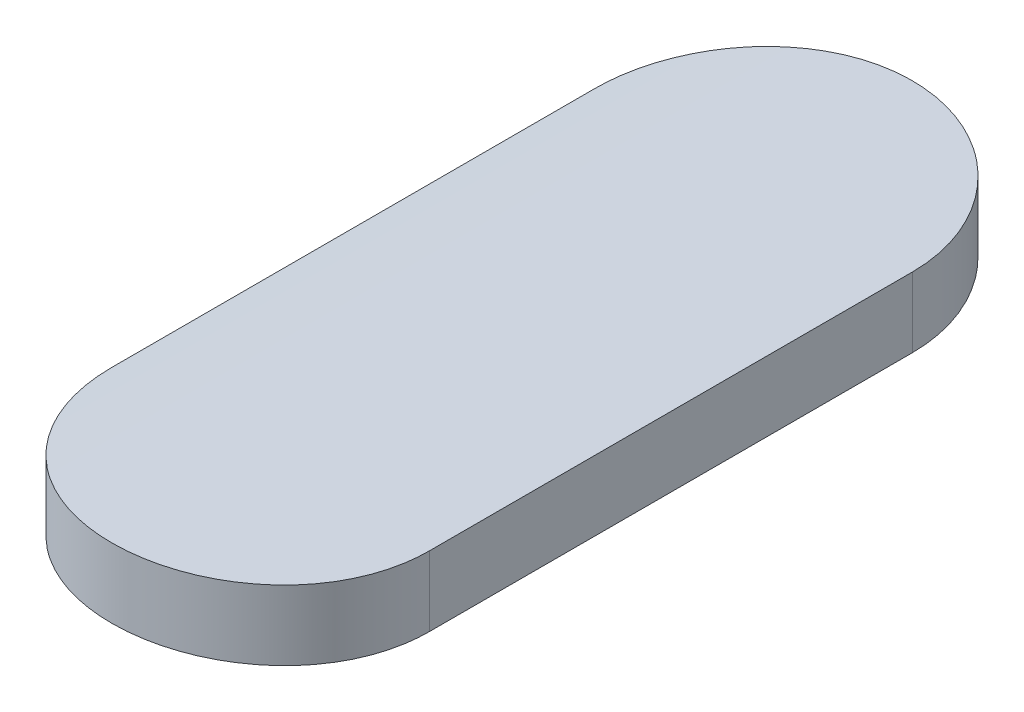
ISO-10303-21;
HEADER;
FILE_DESCRIPTION(('STEP AP214'),'2;1');
FILE_NAME('part.step','',(''),(''),'','','');
FILE_SCHEMA(('AUTOMOTIVE_DESIGN { 1 0 10303 214 1 1 1 1 }'));
ENDSEC;
DATA;
#1=APPLICATION_CONTEXT('core data for automotive mechanical design processes');
#2=APPLICATION_PROTOCOL_DEFINITION('international standard','automotive_design',2000,#1);
#3=PRODUCT_CONTEXT('',#1,'mechanical');
#4=PRODUCT('Part','Part','',(#3));
#5=PRODUCT_RELATED_PRODUCT_CATEGORY('part','',(#4));
#6=PRODUCT_DEFINITION_FORMATION('','',#4);
#7=PRODUCT_DEFINITION_CONTEXT('part definition',#1,'design');
#8=PRODUCT_DEFINITION('design','',#6,#7);
#9=PRODUCT_DEFINITION_SHAPE('','',#8);
#10=(LENGTH_UNIT() NAMED_UNIT(*) SI_UNIT(.MILLI.,.METRE.));
#11=(NAMED_UNIT(*) PLANE_ANGLE_UNIT() SI_UNIT($,.RADIAN.));
#12=(NAMED_UNIT(*) SI_UNIT($,.STERADIAN.) SOLID_ANGLE_UNIT());
#13=UNCERTAINTY_MEASURE_WITH_UNIT(LENGTH_MEASURE(1.E-05),#10,'distance_accuracy_value','');
#14=(GEOMETRIC_REPRESENTATION_CONTEXT(3) GLOBAL_UNCERTAINTY_ASSIGNED_CONTEXT((#13)) GLOBAL_UNIT_ASSIGNED_CONTEXT((#10,
#11,#12)) REPRESENTATION_CONTEXT('',''));
#15=CARTESIAN_POINT('',(0.,0.,0.));
#16=DIRECTION('',(0.,0.,1.));
#17=DIRECTION('',(1.,0.,0.));
#18=AXIS2_PLACEMENT_3D('',#15,#16,#17);
#19=CARTESIAN_POINT('',(-102.183303397109,-58.0021041199526,0.810125243112793));
#20=DIRECTION('',(0.,0.,1.));
#21=DIRECTION('',(1.,0.,0.));
#22=AXIS2_PLACEMENT_3D('',#19,#20,#21);
#23=CYLINDRICAL_SURFACE('',#22,3.03);
#24=DIRECTION('',(0.,0.,1.));
#25=VECTOR('',#24,1.);
#26=CARTESIAN_POINT('',(-101.909719824806,-54.9844805468465,2.91890539461168));
#27=LINE('',#26,#25);
#28=CARTESIAN_POINT('',(-101.909719824806,-54.9844805468465,2.087211334809));
#29=VERTEX_POINT('',#28);
#30=CARTESIAN_POINT('',(-101.909719824806,-54.9844805468465,2.91890539461168));
#31=VERTEX_POINT('',#30);
#32=EDGE_CURVE('E63',#29,#31,#27,.T.);
#33=ORIENTED_EDGE('',*,*,#32,.T.);
#34=CARTESIAN_POINT('',(-102.456886969413,-54.9844805468465,2.91890539461168));
#35=CARTESIAN_POINT('',(-102.45690018856,-54.9844850850065,2.93426326797204));
#36=CARTESIAN_POINT('',(-102.455594583745,-54.9843634291541,2.94961652885538));
#37=CARTESIAN_POINT('',(-102.450444037557,-54.9839013638385,2.97987409353102));
#38=CARTESIAN_POINT('',(-102.446601388075,-54.9835611518201,2.99477878984865));
#39=CARTESIAN_POINT('',(-102.43647274975,-54.982695325965,3.02373442762979));
#40=CARTESIAN_POINT('',(-102.430185801304,-54.9821696393207,3.03778503127848));
#41=CARTESIAN_POINT('',(-102.41535362176,-54.9809936958497,3.06463003077991));
#42=CARTESIAN_POINT('',(-102.406808694357,-54.9803434557786,3.07742459525067));
#43=CARTESIAN_POINT('',(-102.387675519313,-54.9789891929714,3.10143281801022));
#44=CARTESIAN_POINT('',(-102.37708208878,-54.9782850366116,3.11264233874841));
#45=CARTESIAN_POINT('',(-102.354162558468,-54.976903511139,3.13312815470867));
#46=CARTESIAN_POINT('',(-102.341836195345,-54.9762261461177,3.14240415557377));
#47=CARTESIAN_POINT('',(-102.315775963507,-54.9749732653347,3.15877232350382));
#48=CARTESIAN_POINT('',(-102.30203976608,-54.9743979225072,3.16586079734287));
#49=CARTESIAN_POINT('',(-102.273566893701,-54.9734154280022,3.17762868466413));
#50=CARTESIAN_POINT('',(-102.258830299632,-54.9730082627462,3.18230829264124));
#51=CARTESIAN_POINT('',(-102.228816839615,-54.9724089065577,3.18911389149604));
#52=CARTESIAN_POINT('',(-102.213541557574,-54.9722161320768,3.19124681534253));
#53=CARTESIAN_POINT('',(-102.182848304728,-54.9720652956585,3.19291995032191));
#54=CARTESIAN_POINT('',(-102.167430333496,-54.972107234425,3.19246015367994));
#55=CARTESIAN_POINT('',(-102.13693723616,-54.9724206277345,3.18896646039311));
#56=CARTESIAN_POINT('',(-102.121861239453,-54.9726914108666,3.18594009376717));
#57=CARTESIAN_POINT('',(-102.092432133361,-54.9734312715637,3.17741089924443));
#58=CARTESIAN_POINT('',(-102.078079028347,-54.9739003503275,3.17190805637773));
#59=CARTESIAN_POINT('',(-102.050478912772,-54.9749852107613,3.15857364552087));
#60=CARTESIAN_POINT('',(-102.037233555316,-54.9756012065815,3.15073867398615));
#61=CARTESIAN_POINT('',(-102.012243656792,-54.9769106737635,3.13296527765198));
#62=CARTESIAN_POINT('',(-102.00049908344,-54.9776041434581,3.12302689811199));
#63=CARTESIAN_POINT('',(-101.978800875656,-54.9789935419706,3.10128783989949));
#64=CARTESIAN_POINT('',(-101.968853536883,-54.9796894710466,3.08948087650394));
#65=CARTESIAN_POINT('',(-101.951078187108,-54.9810031213351,3.06435723079201));
#66=CARTESIAN_POINT('',(-101.943250825879,-54.9816208185386,3.0510400873762));
#67=CARTESIAN_POINT('',(-101.929937183968,-54.9827084570826,3.02326549613394));
#68=CARTESIAN_POINT('',(-101.924452666358,-54.9831782870781,3.00880719920953));
#69=CARTESIAN_POINT('',(-101.916001398058,-54.9839144740036,2.97918744791656));
#70=CARTESIAN_POINT('',(-101.913030832485,-54.9841811391716,2.96402709591596));
#71=CARTESIAN_POINT('',(-101.910262288898,-54.9844315961996,2.93882571566526));
#72=CARTESIAN_POINT('',(-101.90971524255,-54.9844819522347,2.92886308187312));
#73=CARTESIAN_POINT('',(-101.909719824805,-54.9844805468465,2.91890539461168));
#74=B_SPLINE_CURVE_WITH_KNOTS('',3,(#34,#35,#36,#37,#38,#39,#40,#41,#42,#43,#44,#45,#46,#47,#48,
#49,#50,#51,#52,#53,#54,#55,#56,#57,#58,#59,#60,#61,#62,#63,#64,#65,#66,#67,#68,#69,#70,#71,#72,
#73),.UNSPECIFIED.,.F.,.F.,(4,2,2,2,2,2,2,2,2,2,2,2,2,2,2,2,2,2,2,4),(0.,0.0460110092394263,
0.0919805102672434,0.137968076626714,0.183949460880791,0.230048741249591,0.27615503460575,
0.322338749160998,0.368518734199196,0.414572712346615,0.460626828597777,0.506546292990887,
0.552466034963506,0.598453124267902,0.644439224158948,0.690583414231252,0.736741731520291,
0.782934723603281,0.829057492186285,0.85892871626178),.UNSPECIFIED.);
#75=CARTESIAN_POINT('',(-102.456886969413,-54.9844805468465,2.91890539461168));
#76=VERTEX_POINT('',#75);
#77=EDGE_CURVE('E21',#76,#31,#74,.T.);
#78=ORIENTED_EDGE('',*,*,#77,.F.);
#79=DIRECTION('',(0.,0.,-1.));
#80=VECTOR('',#79,1.);
#81=CARTESIAN_POINT('',(-102.456886969413,-54.9844805468465,2.087211334809));
#82=LINE('',#81,#80);
#83=CARTESIAN_POINT('',(-102.456886969413,-54.9844805468465,2.087211334809));
#84=VERTEX_POINT('',#83);
#85=EDGE_CURVE('E60',#76,#84,#82,.T.);
#86=ORIENTED_EDGE('',*,*,#85,.T.);
#87=CARTESIAN_POINT('',(-101.909719824805,-54.9844805468465,2.087211334809));
#88=CARTESIAN_POINT('',(-101.909706603611,-54.9844850849377,2.07185351137855));
#89=CARTESIAN_POINT('',(-101.91101220096,-54.9843634299103,2.05650030029874));
#90=CARTESIAN_POINT('',(-101.916162732774,-54.9839013660614,2.02624273282166));
#91=CARTESIAN_POINT('',(-101.920005391793,-54.983561153268,2.01133798671698));
#92=CARTESIAN_POINT('',(-101.930134151815,-54.9826953165674,1.98238198878401));
#93=CARTESIAN_POINT('',(-101.936421257281,-54.9821696164489,1.96833109056332));
#94=CARTESIAN_POINT('',(-101.951253551068,-54.9809936677021,1.94148614241005));
#95=CARTESIAN_POINT('',(-101.959798338105,-54.980343441213,1.92869186967649));
#96=CARTESIAN_POINT('',(-101.978930162296,-54.9789892694197,1.90468527296885));
#97=CARTESIAN_POINT('',(-101.989522196764,-54.9782851952686,1.89347693864892));
#98=CARTESIAN_POINT('',(-102.012441554963,-54.9769036653171,1.87299066518109));
#99=CARTESIAN_POINT('',(-102.024769532786,-54.9762262196739,1.86371345695052));
#100=CARTESIAN_POINT('',(-102.050837529914,-54.9749729209117,1.84733998425859));
#101=CARTESIAN_POINT('',(-102.064580476045,-54.9743972853461,1.84024836665392));
#102=CARTESIAN_POINT('',(-102.093057577958,-54.9734149909817,1.82848274613002));
#103=CARTESIAN_POINT('',(-102.107790555852,-54.9730081353731,1.82380592581219));
#104=CARTESIAN_POINT('',(-102.132720740683,-54.972510035285,1.81815184259439));
#105=CARTESIAN_POINT('',(-102.142760012056,-54.972358537245,1.81645765990129));
#106=CARTESIAN_POINT('',(-102.162965855142,-54.9721555261584,1.81419539226587));
#107=CARTESIAN_POINT('',(-102.173132429046,-54.9721040148336,1.81362732671486));
#108=CARTESIAN_POINT('',(-102.198637794649,-54.9721042784367,1.8136284195311));
#109=CARTESIAN_POINT('',(-102.21398218033,-54.9722217636421,1.81492130813206));
#110=CARTESIAN_POINT('',(-102.244245434795,-54.9726791209169,1.82005951096344));
#111=CARTESIAN_POINT('',(-102.259163830807,-54.9730192307578,1.82390755426018));
#112=CARTESIAN_POINT('',(-102.2881332593,-54.9738834186235,1.8340435272841));
#113=CARTESIAN_POINT('',(-102.302184779422,-54.97440739209,1.84033007051509));
#114=CARTESIAN_POINT('',(-102.329030317659,-54.9755806299851,1.85516219686659));
#115=CARTESIAN_POINT('',(-102.341824563905,-54.9762298716205,1.86370736912109));
#116=CARTESIAN_POINT('',(-102.365832699982,-54.9775829614183,1.8828409464477));
#117=CARTESIAN_POINT('',(-102.377042394913,-54.9782869471526,1.89343460553395));
#118=CARTESIAN_POINT('',(-102.397527723683,-54.9796690712488,1.91635426134947));
#119=CARTESIAN_POINT('',(-102.406803197114,-54.980347207463,1.92868040161448));
#120=CARTESIAN_POINT('',(-102.423172646041,-54.9816024211497,1.95474225105209));
#121=CARTESIAN_POINT('',(-102.430262308272,-54.9821792978532,1.96848067679207));
#122=CARTESIAN_POINT('',(-102.442029416205,-54.9831645823514,1.99695721882436));
#123=CARTESIAN_POINT('',(-102.446708164687,-54.9835730811081,2.01169479032806));
#124=CARTESIAN_POINT('',(-102.452364578077,-54.984073110083,2.03663670312068));
#125=CARTESIAN_POINT('',(-102.454059328348,-54.9842251554516,2.04668307209212));
#126=CARTESIAN_POINT('',(-102.456320437115,-54.9844291774748,2.0668886347348));
#127=CARTESIAN_POINT('',(-102.456888379817,-54.9844812946176,2.07704764978422));
#128=CARTESIAN_POINT('',(-102.456886969413,-54.9844805468465,2.087211334809));
#129=B_SPLINE_CURVE_WITH_KNOTS('',3,(#87,#88,#89,#90,#91,#92,#93,#94,#95,#96,#97,#98,#99,#100,
#101,#102,#103,#104,#105,#106,#107,#108,#109,#110,#111,#112,#113,#114,#115,#116,#117,#118,#119,
#120,#121,#122,#123,#124,#125,#126,#127,#128),.UNSPECIFIED.,.F.,.F.,(4,2,2,2,2,2,2,2,2,2,2,2,2,
2,2,2,2,2,2,2,4),(0.,0.0460108603236384,0.0919805102691049,0.13796906986794,0.183949460872792,
0.230043540383748,0.276155034576633,0.322363902164524,0.368518734300647,0.399006507520629,
0.429494805724186,0.475460900795526,0.521476169693505,0.567465313228801,0.613446096654021,
0.659546415719316,0.705650556441149,0.751845100716581,0.798014656700601,0.828523596054453,
0.858989611669718),.UNSPECIFIED.);
#130=EDGE_CURVE('E77',#29,#84,#129,.T.);
#131=ORIENTED_EDGE('',*,*,#130,.F.);
#132=EDGE_LOOP('',(#33,#78,#86,#131));
#133=FACE_BOUND('',#132,.T.);
#134=ADVANCED_FACE('F17',(#133),#23,.F.);
#135=CARTESIAN_POINT('',(-102.183303397109,-56.4871041199525,2.91890539461168));
#136=DIRECTION('',(0.,-1.,0.));
#137=DIRECTION('',(0.,0.,-1.));
#138=AXIS2_PLACEMENT_3D('',#135,#136,#137);
#139=CYLINDRICAL_SURFACE('',#138,0.273583572303515);
#140=DIRECTION('',(0.,1.,0.));
#141=VECTOR('',#140,1.);
#142=CARTESIAN_POINT('',(-102.456886969413,-56.4871041199525,2.91890539461168));
#143=LINE('',#142,#141);
#144=CARTESIAN_POINT('',(-102.456886969413,-54.8640072398411,2.91890539461168));
#145=VERTEX_POINT('',#144);
#146=EDGE_CURVE('E67',#145,#76,#143,.F.);
#147=ORIENTED_EDGE('',*,*,#146,.T.);
#148=ORIENTED_EDGE('',*,*,#77,.T.);
#149=DIRECTION('',(0.,1.,0.));
#150=VECTOR('',#149,1.);
#151=CARTESIAN_POINT('',(-101.909719824806,-56.4871041199525,2.91890539461168));
#152=LINE('',#151,#150);
#153=CARTESIAN_POINT('',(-101.909719824806,-54.8640072398411,2.91890539461168));
#154=VERTEX_POINT('',#153);
#155=EDGE_CURVE('E83',#31,#154,#152,.T.);
#156=ORIENTED_EDGE('',*,*,#155,.T.);
#157=CARTESIAN_POINT('',(-102.456886969413,-54.8640072398411,2.91890539461168));
#158=CARTESIAN_POINT('',(-102.45690017744,-54.8640116038495,2.93426574188204));
#159=CARTESIAN_POINT('',(-102.455594165121,-54.8638945821352,2.94962152986612));
#160=CARTESIAN_POINT('',(-102.450441862128,-54.8634501023721,2.97988435395533));
#161=CARTESIAN_POINT('',(-102.446597831778,-54.8631228315755,2.99479177702831));
#162=CARTESIAN_POINT('',(-102.43646531811,-54.8622899162493,3.02375284212875));
#163=CARTESIAN_POINT('',(-102.430175861723,-54.8617842007215,3.03780614171135));
#164=CARTESIAN_POINT('',(-102.415337557483,-54.8606529156442,3.06465598176264));
#165=CARTESIAN_POINT('',(-102.40678902391,-54.8600273627696,3.07745269670626));
#166=CARTESIAN_POINT('',(-102.387649540032,-54.858724650616,3.10146198054393));
#167=CARTESIAN_POINT('',(-102.37705378966,-54.85804737236,3.11267071692668));
#168=CARTESIAN_POINT('',(-102.354129746989,-54.8567186189181,3.13315438947129));
#169=CARTESIAN_POINT('',(-102.341801191367,-54.8560671476734,3.14242903118867));
#170=CARTESIAN_POINT('',(-102.315738757083,-54.8548623045616,3.15879278989864));
#171=CARTESIAN_POINT('',(-102.302002730673,-54.854309086249,3.1658784984769));
#172=CARTESIAN_POINT('',(-102.273531133867,-54.8533644337177,3.17764106408049));
#173=CARTESIAN_POINT('',(-102.258795643014,-54.8529729866417,3.18231811255018));
#174=CARTESIAN_POINT('',(-102.228782091928,-54.8523967862496,3.18911980974592));
#175=CARTESIAN_POINT('',(-102.213505495177,-54.8522115136778,3.19125087160693));
#176=CARTESIAN_POINT('',(-102.182810025518,-54.8520667749048,3.19291994150952));
#177=CARTESIAN_POINT('',(-102.167391151973,-54.8521073097163,3.19245793792023));
#178=CARTESIAN_POINT('',(-102.136893153251,-54.8524091989506,3.18895913638965));
#179=CARTESIAN_POINT('',(-102.121813221565,-54.8526699554928,3.18592930976002));
#180=CARTESIAN_POINT('',(-102.092376822884,-54.8533822737681,3.17739172534582));
#181=CARTESIAN_POINT('',(-102.078020359791,-54.8538338365303,3.17188395419732));
#182=CARTESIAN_POINT('',(-102.050415930298,-54.8548780121511,3.15853894972632));
#183=CARTESIAN_POINT('',(-102.037169500118,-54.8554708162598,3.15069855426435));
#184=CARTESIAN_POINT('',(-102.01217861772,-54.8567308333417,3.13291355438156));
#185=CARTESIAN_POINT('',(-102.000434130094,-54.8573980445601,3.12296899957858));
#186=CARTESIAN_POINT('',(-101.978740535791,-54.8587344683245,3.10122014370146));
#187=CARTESIAN_POINT('',(-101.968797240192,-54.8594036805078,3.0894100455299));
#188=CARTESIAN_POINT('',(-101.951030530104,-54.8606667104951,3.06428108165889));
#189=CARTESIAN_POINT('',(-101.943207767305,-54.8612605050917,3.05096175391694));
#190=CARTESIAN_POINT('',(-101.929903785219,-54.8623058530949,3.02318424409219));
#191=CARTESIAN_POINT('',(-101.924424292344,-54.8627573015633,3.00872523159907));
#192=CARTESIAN_POINT('',(-101.915982962283,-54.863464474176,2.97910532559388));
#193=CARTESIAN_POINT('',(-101.913017308266,-54.8637204949845,2.96394553313878));
#194=CARTESIAN_POINT('',(-101.910259349305,-54.8639604241394,2.93877172062167));
#195=CARTESIAN_POINT('',(-101.909715280934,-54.8640085803269,2.92883607901394));
#196=CARTESIAN_POINT('',(-101.909719824805,-54.8640072398411,2.91890539461168));
#197=B_SPLINE_CURVE_WITH_KNOTS('',3,(#157,#158,#159,#160,#161,#162,#163,#164,#165,#166,#167,
#168,#169,#170,#171,#172,#173,#174,#175,#176,#177,#178,#179,#180,#181,#182,#183,#184,#185,#186,
#187,#188,#189,#190,#191,#192,#193,#194,#195,#196),.UNSPECIFIED.,.F.,.F.,(4,2,2,2,2,2,2,2,2,2,2,
2,2,2,2,2,2,2,2,4),(0.,0.0460185269940187,0.0919961256717319,0.137992038231911,
0.183981555270097,0.230080241017493,0.276185939663906,0.322363072340185,0.368536534213801,
0.414593441972159,0.460650556313075,0.506583030539238,0.552515752488987,0.598511027446186,
0.644505217917067,0.690645251790524,0.736799449546953,0.782987593228105,0.82910548190241,
0.858895844339709),.UNSPECIFIED.);
#198=EDGE_CURVE('E70',#145,#154,#197,.T.);
#199=ORIENTED_EDGE('',*,*,#198,.F.);
#200=EDGE_LOOP('',(#147,#148,#156,#199));
#201=FACE_BOUND('',#200,.T.);
#202=ADVANCED_FACE('F68',(#201),#139,.T.);
#203=CARTESIAN_POINT('',(-101.909719824806,-56.4871041199525,2.91890539461168));
#204=DIRECTION('',(-1.,0.,0.));
#205=DIRECTION('',(0.,0.,1.));
#206=AXIS2_PLACEMENT_3D('',#203,#204,#205);
#207=PLANE('',#206);
#208=DIRECTION('',(0.,0.,1.));
#209=VECTOR('',#208,1.);
#210=CARTESIAN_POINT('',(-101.909719824806,-54.8640072398411,0.810125243112793));
#211=LINE('',#210,#209);
#212=CARTESIAN_POINT('',(-101.909719824806,-54.8640072398411,2.087211334809));
#213=VERTEX_POINT('',#212);
#214=EDGE_CURVE('E92',#154,#213,#211,.F.);
#215=ORIENTED_EDGE('',*,*,#214,.F.);
#216=ORIENTED_EDGE('',*,*,#155,.F.);
#217=ORIENTED_EDGE('',*,*,#32,.F.);
#218=DIRECTION('',(0.,-1.,0.));
#219=VECTOR('',#218,1.);
#220=CARTESIAN_POINT('',(-101.909719824805,-56.4871041199525,2.087211334809));
#221=LINE('',#220,#219);
#222=EDGE_CURVE('E80',#213,#29,#221,.T.);
#223=ORIENTED_EDGE('',*,*,#222,.F.);
#224=EDGE_LOOP('',(#215,#216,#217,#223));
#225=FACE_BOUND('',#224,.T.);
#226=ADVANCED_FACE('F103',(#225),#207,.F.);
#227=CARTESIAN_POINT('',(-102.183303397109,-56.4871041199525,2.087211334809));
#228=DIRECTION('',(0.,-1.,0.));
#229=DIRECTION('',(0.,0.,-1.));
#230=AXIS2_PLACEMENT_3D('',#227,#228,#229);
#231=CYLINDRICAL_SURFACE('',#230,0.273583572303522);
#232=ORIENTED_EDGE('',*,*,#130,.T.);
#233=DIRECTION('',(0.,1.,0.));
#234=VECTOR('',#233,1.);
#235=CARTESIAN_POINT('',(-102.456886969413,-56.4871041199525,2.087211334809));
#236=LINE('',#235,#234);
#237=CARTESIAN_POINT('',(-102.456886969413,-54.8640072398411,2.087211334809));
#238=VERTEX_POINT('',#237);
#239=EDGE_CURVE('E73',#84,#238,#236,.T.);
#240=ORIENTED_EDGE('',*,*,#239,.T.);
#241=CARTESIAN_POINT('',(-101.909719824805,-54.8640072398411,2.087211334809));
#242=CARTESIAN_POINT('',(-101.909706614729,-54.8640116037829,2.07185103793721));
#243=CARTESIAN_POINT('',(-101.911012619502,-54.8638945828694,2.05649530022383));
#244=CARTESIAN_POINT('',(-101.916164907966,-54.86345010453,2.02623247330697));
#245=CARTESIAN_POINT('',(-101.920008947934,-54.8631228329808,2.01132499997943));
#246=CARTESIAN_POINT('',(-101.930141583729,-54.8622899071895,1.98236357355652));
#247=CARTESIAN_POINT('',(-101.936431197545,-54.8617841786715,1.9683099787149));
#248=CARTESIAN_POINT('',(-101.951269616301,-54.8606528885075,1.9414601901459));
#249=CARTESIAN_POINT('',(-101.959818009113,-54.8600273487274,1.92866376762399));
#250=CARTESIAN_POINT('',(-101.978956139828,-54.8587247242468,1.90465611221419));
#251=CARTESIAN_POINT('',(-101.989550492026,-54.8580475251671,1.89344856374548));
#252=CARTESIAN_POINT('',(-102.012474362225,-54.8567187674053,1.87296443296164));
#253=CARTESIAN_POINT('',(-102.024804534801,-54.8560672185151,1.86368858237401));
#254=CARTESIAN_POINT('',(-102.05087474204,-54.8548619730904,1.84731951575747));
#255=CARTESIAN_POINT('',(-102.064617522737,-54.8543084730681,1.84023066235227));
#256=CARTESIAN_POINT('',(-102.093093350309,-54.853364013255,1.82847036529674));
#257=CARTESIAN_POINT('',(-102.107825220786,-54.8529728642116,1.82379610538733));
#258=CARTESIAN_POINT('',(-102.132748750118,-54.8524941369114,1.81814678940242));
#259=CARTESIAN_POINT('',(-102.142782592153,-54.8523485718543,1.81645449299927));
#260=CARTESIAN_POINT('',(-102.162977288961,-54.8521535119536,1.81419475201689));
#261=CARTESIAN_POINT('',(-102.173138145954,-54.8521040187922,1.81362732713497));
#262=CARTESIAN_POINT('',(-102.198640356188,-54.8521042725794,1.81362841937286));
#263=CARTESIAN_POINT('',(-102.213987317991,-54.8522173200861,1.81492173460734));
#264=CARTESIAN_POINT('',(-102.244255772089,-54.8526574002586,1.82006171303983));
#265=CARTESIAN_POINT('',(-102.259176791065,-54.852984661991,1.82391110960665));
#266=CARTESIAN_POINT('',(-102.288151503218,-54.8538161955517,1.83405088994411));
#267=CARTESIAN_POINT('',(-102.302205675887,-54.8543203684713,1.84033990995983));
#268=CARTESIAN_POINT('',(-102.329056015968,-54.855449232041,1.85517810392037));
#269=CARTESIAN_POINT('',(-102.341852414088,-54.8560739005266,1.86372686230581));
#270=CARTESIAN_POINT('',(-102.365861648661,-54.8573755748558,1.88286673297239));
#271=CARTESIAN_POINT('',(-102.37707059166,-54.8580527032867,1.89346272101646));
#272=CARTESIAN_POINT('',(-102.397553834087,-54.8593819911154,1.91638691545837));
#273=CARTESIAN_POINT('',(-102.406827974061,-54.8600341484516,1.92871526448627));
#274=CARTESIAN_POINT('',(-102.423193038246,-54.8612410770389,1.95477932516453));
#275=CARTESIAN_POINT('',(-102.430279939323,-54.8617956680339,1.96851756903057));
#276=CARTESIAN_POINT('',(-102.442041740195,-54.8627427988405,1.99699282416755));
#277=CARTESIAN_POINT('',(-102.446717938022,-54.8631354258381,2.01172929310159));
#278=CARTESIAN_POINT('',(-102.452369613874,-54.8636158769288,2.03666460862056));
#279=CARTESIAN_POINT('',(-102.454062491604,-54.8637619262361,2.04670560426666));
#280=CARTESIAN_POINT('',(-102.456321074794,-54.8639578981373,2.06690007783351));
#281=CARTESIAN_POINT('',(-102.456888370015,-54.8640079563048,2.07705337671324));
#282=CARTESIAN_POINT('',(-102.456886969413,-54.8640072398411,2.087211334809));
#283=B_SPLINE_CURVE_WITH_KNOTS('',3,(#241,#242,#243,#244,#245,#246,#247,#248,#249,#250,#251,
#252,#253,#254,#255,#256,#257,#258,#259,#260,#261,#262,#263,#264,#265,#266,#267,#268,#269,#270,
#271,#272,#273,#274,#275,#276,#277,#278,#279,#280,#281,#282),.UNSPECIFIED.,.F.,.F.,(4,2,2,2,2,2,
2,2,2,2,2,2,2,2,2,2,2,2,2,2,4),(0.,0.0460183766811861,0.091996125673531,0.137993033772371,
0.183981555262629,0.230075033156867,0.276185939636115,0.322388242159418,0.368536534298569,
0.399007184528176,0.429478368315913,0.475452175726987,0.521475224990675,0.567472584255437,
0.613461490616034,0.659561307046458,0.705664921228198,0.751852838301488,0.798015859631041,
0.828507846884671,0.858956736830141),.UNSPECIFIED.);
#284=EDGE_CURVE('E30',#213,#238,#283,.T.);
#285=ORIENTED_EDGE('',*,*,#284,.F.);
#286=ORIENTED_EDGE('',*,*,#222,.T.);
#287=EDGE_LOOP('',(#232,#240,#285,#286));
#288=FACE_BOUND('',#287,.T.);
#289=ADVANCED_FACE('F99',(#288),#231,.T.);
#290=CARTESIAN_POINT('',(-102.456886969413,-56.4871041199525,2.087211334809));
#291=DIRECTION('',(1.,0.,0.));
#292=DIRECTION('',(0.,0.,-1.));
#293=AXIS2_PLACEMENT_3D('',#290,#291,#292);
#294=PLANE('',#293);
#295=DIRECTION('',(0.,0.,1.));
#296=VECTOR('',#295,1.);
#297=CARTESIAN_POINT('',(-102.456886969413,-54.8640072398411,0.810125243112793));
#298=LINE('',#297,#296);
#299=EDGE_CURVE('E11',#238,#145,#298,.T.);
#300=ORIENTED_EDGE('',*,*,#299,.F.);
#301=ORIENTED_EDGE('',*,*,#239,.F.);
#302=ORIENTED_EDGE('',*,*,#85,.F.);
#303=ORIENTED_EDGE('',*,*,#146,.F.);
#304=EDGE_LOOP('',(#300,#301,#302,#303));
#305=FACE_BOUND('',#304,.T.);
#306=ADVANCED_FACE('F76',(#305),#294,.F.);
#307=CARTESIAN_POINT('',(-102.183303397109,-58.0021041199526,0.810125243112793));
#308=DIRECTION('',(0.,0.,1.));
#309=DIRECTION('',(1.,0.,0.));
#310=AXIS2_PLACEMENT_3D('',#307,#308,#309);
#311=CYLINDRICAL_SURFACE('',#310,3.15);
#312=ORIENTED_EDGE('',*,*,#284,.T.);
#313=ORIENTED_EDGE('',*,*,#299,.T.);
#314=ORIENTED_EDGE('',*,*,#198,.T.);
#315=ORIENTED_EDGE('',*,*,#214,.T.);
#316=EDGE_LOOP('',(#312,#313,#314,#315));
#317=FACE_BOUND('',#316,.T.);
#318=ADVANCED_FACE('F96',(#317),#311,.T.);
#319=CLOSED_SHELL('',(#134,#202,#226,#289,#306,#318));
#320=MANIFOLD_SOLID_BREP('B1',#319);
#321=ADVANCED_BREP_SHAPE_REPRESENTATION('',(#18,#320),#14);
#322=SHAPE_DEFINITION_REPRESENTATION(#9,#321);
ENDSEC;
END-ISO-10303-21;
